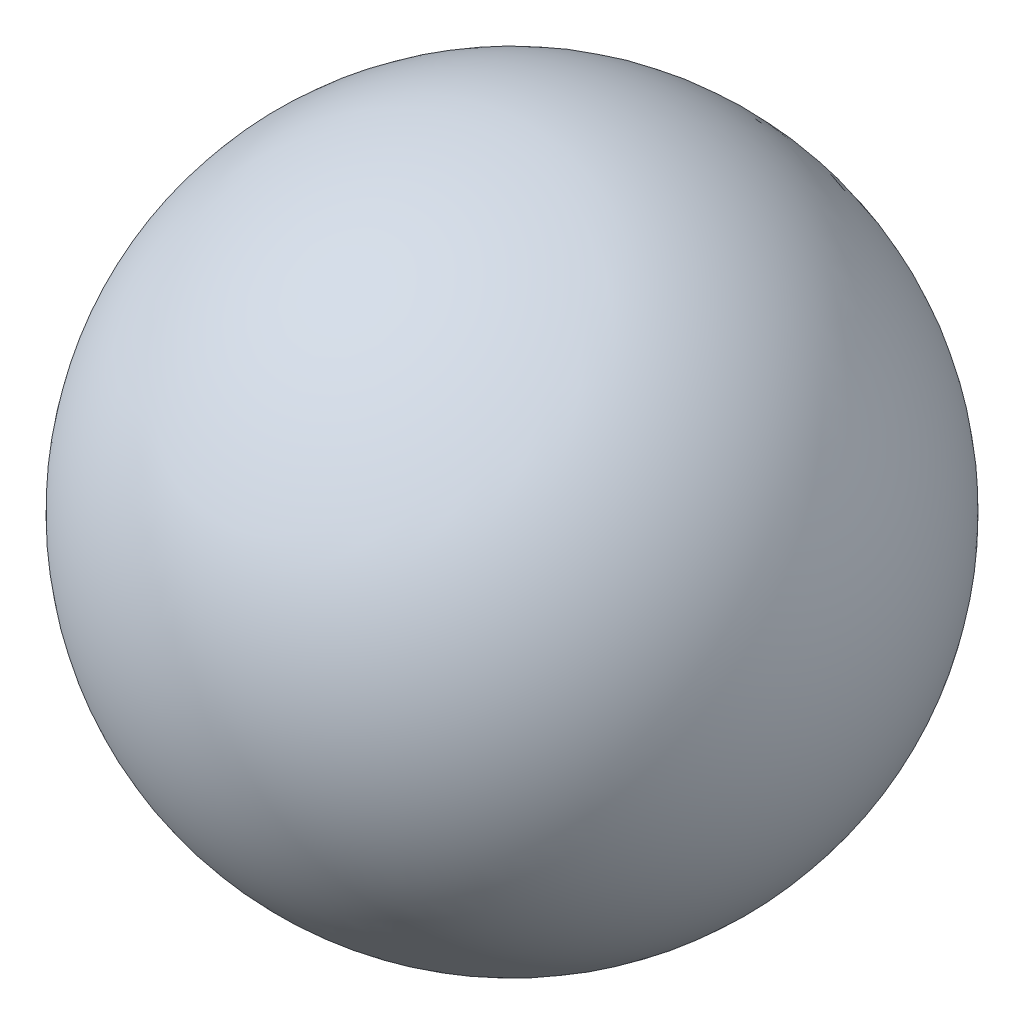
ISO-10303-21;
HEADER;
FILE_DESCRIPTION(('STEP AP214'),'2;1');
FILE_NAME('part.step','',(''),(''),'','','');
FILE_SCHEMA(('AUTOMOTIVE_DESIGN { 1 0 10303 214 1 1 1 1 }'));
ENDSEC;
DATA;
#1=APPLICATION_CONTEXT('core data for automotive mechanical design processes');
#2=APPLICATION_PROTOCOL_DEFINITION('international standard','automotive_design',2000,#1);
#3=PRODUCT_CONTEXT('',#1,'mechanical');
#4=PRODUCT('Part','Part','',(#3));
#5=PRODUCT_RELATED_PRODUCT_CATEGORY('part','',(#4));
#6=PRODUCT_DEFINITION_FORMATION('','',#4);
#7=PRODUCT_DEFINITION_CONTEXT('part definition',#1,'design');
#8=PRODUCT_DEFINITION('design','',#6,#7);
#9=PRODUCT_DEFINITION_SHAPE('','',#8);
#10=(LENGTH_UNIT() NAMED_UNIT(*) SI_UNIT(.MILLI.,.METRE.));
#11=(NAMED_UNIT(*) PLANE_ANGLE_UNIT() SI_UNIT($,.RADIAN.));
#12=(NAMED_UNIT(*) SI_UNIT($,.STERADIAN.) SOLID_ANGLE_UNIT());
#13=UNCERTAINTY_MEASURE_WITH_UNIT(LENGTH_MEASURE(1.E-05),#10,'distance_accuracy_value','');
#14=(GEOMETRIC_REPRESENTATION_CONTEXT(3) GLOBAL_UNCERTAINTY_ASSIGNED_CONTEXT((#13)) GLOBAL_UNIT_ASSIGNED_CONTEXT((#10,
#11,#12)) REPRESENTATION_CONTEXT('',''));
#15=CARTESIAN_POINT('',(0.,0.,0.));
#16=DIRECTION('',(0.,0.,1.));
#17=DIRECTION('',(1.,0.,0.));
#18=AXIS2_PLACEMENT_3D('',#15,#16,#17);
#19=CARTESIAN_POINT('',(49.75,-38.4167836127539,-36.5116109902157));
#20=DIRECTION('',(0.,-0.724851812050188,-0.68890481967218));
#21=DIRECTION('',(0.173648177666934,0.67843880750064,-0.713839684291973));
#22=AXIS2_PLACEMENT_3D('',#19,#20,#21);
#23=SPHERICAL_SURFACE('',#22,5.95);
#24=CARTESIAN_POINT('',(49.75,-34.1039153310553,-32.4126273131662));
#25=VERTEX_POINT('',#24);
#26=VERTEX_LOOP('',#25);
#27=FACE_BOUND('',#26,.T.);
#28=CARTESIAN_POINT('',(49.75,-42.7296518944525,-40.6105946672652));
#29=VERTEX_POINT('',#28);
#30=VERTEX_LOOP('',#29);
#31=FACE_BOUND('',#30,.T.);
#32=ADVANCED_FACE('F16',(#27,#31),#23,.T.);
#33=CLOSED_SHELL('',(#32));
#34=MANIFOLD_SOLID_BREP('B1',#33);
#35=ADVANCED_BREP_SHAPE_REPRESENTATION('',(#18,#34),#14);
#36=SHAPE_DEFINITION_REPRESENTATION(#9,#35);
ENDSEC;
END-ISO-10303-21;
